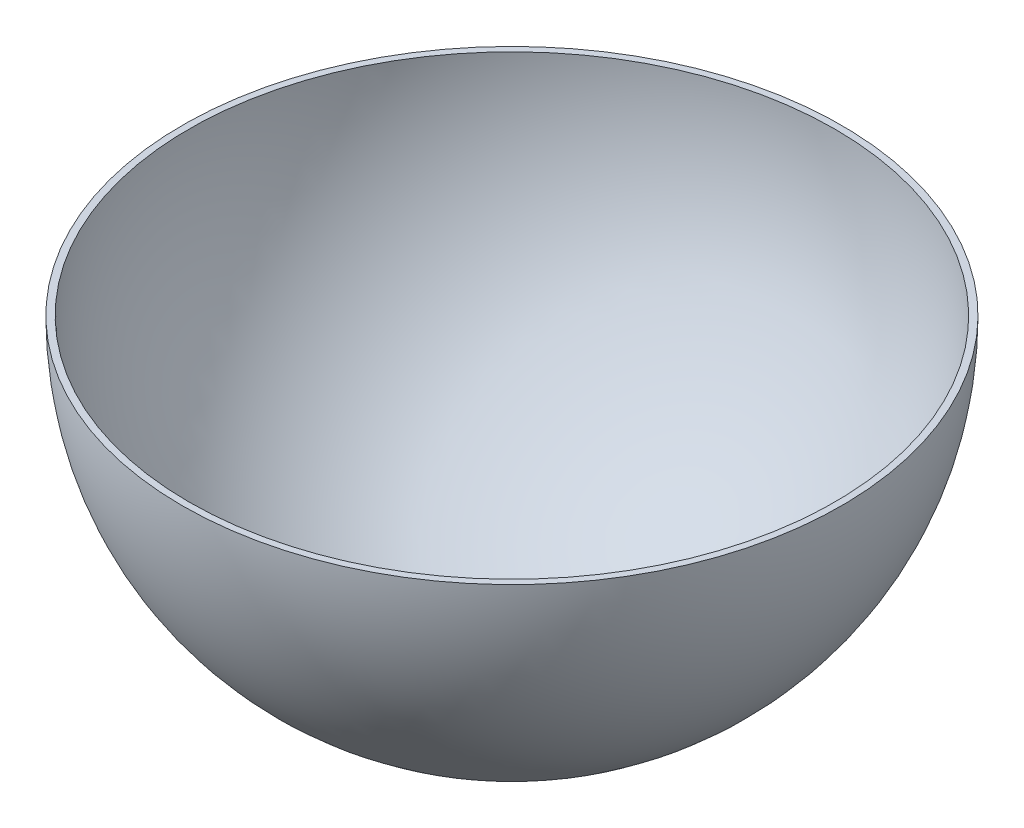
ISO-10303-21;
HEADER;
FILE_DESCRIPTION(('STEP AP214'),'2;1');
FILE_NAME('part.step','',(''),(''),'','','');
FILE_SCHEMA(('AUTOMOTIVE_DESIGN { 1 0 10303 214 1 1 1 1 }'));
ENDSEC;
DATA;
#1=APPLICATION_CONTEXT('core data for automotive mechanical design processes');
#2=APPLICATION_PROTOCOL_DEFINITION('international standard','automotive_design',2000,#1);
#3=PRODUCT_CONTEXT('',#1,'mechanical');
#4=PRODUCT('Part','Part','',(#3));
#5=PRODUCT_RELATED_PRODUCT_CATEGORY('part','',(#4));
#6=PRODUCT_DEFINITION_FORMATION('','',#4);
#7=PRODUCT_DEFINITION_CONTEXT('part definition',#1,'design');
#8=PRODUCT_DEFINITION('design','',#6,#7);
#9=PRODUCT_DEFINITION_SHAPE('','',#8);
#10=(LENGTH_UNIT() NAMED_UNIT(*) SI_UNIT(.MILLI.,.METRE.));
#11=(NAMED_UNIT(*) PLANE_ANGLE_UNIT() SI_UNIT($,.RADIAN.));
#12=(NAMED_UNIT(*) SI_UNIT($,.STERADIAN.) SOLID_ANGLE_UNIT());
#13=UNCERTAINTY_MEASURE_WITH_UNIT(LENGTH_MEASURE(1.E-05),#10,'distance_accuracy_value','');
#14=(GEOMETRIC_REPRESENTATION_CONTEXT(3) GLOBAL_UNCERTAINTY_ASSIGNED_CONTEXT((#13)) GLOBAL_UNIT_ASSIGNED_CONTEXT((#10,
#11,#12)) REPRESENTATION_CONTEXT('',''));
#15=CARTESIAN_POINT('',(0.,0.,0.));
#16=DIRECTION('',(0.,0.,1.));
#17=DIRECTION('',(1.,0.,0.));
#18=AXIS2_PLACEMENT_3D('',#15,#16,#17);
#19=CARTESIAN_POINT('',(0.,0.,0.));
#20=DIRECTION('',(-1.,0.,0.));
#21=DIRECTION('',(0.,-1.,0.));
#22=AXIS2_PLACEMENT_3D('',#19,#20,#21);
#23=SPHERICAL_SURFACE('',#22,98.);
#24=CARTESIAN_POINT('',(0.,0.,0.));
#25=DIRECTION('',(0.,1.,0.));
#26=DIRECTION('',(0.,0.,1.));
#27=AXIS2_PLACEMENT_3D('',#24,#25,#26);
#28=SPHERICAL_SURFACE('',#27,98.);
#29=CARTESIAN_POINT('',(0.,-97.9681070553065,0.));
#30=DIRECTION('',(0.,1.,0.));
#31=DIRECTION('',(0.,0.,1.));
#32=AXIS2_PLACEMENT_3D('',#29,#30,#31);
#33=CIRCLE('',#32,2.5);
#34=CARTESIAN_POINT('',(0.,-97.9681070553065,2.5));
#35=VERTEX_POINT('',#34);
#36=EDGE_CURVE('E47',#35,#35,#33,.T.);
#37=ORIENTED_EDGE('',*,*,#36,.F.);
#38=EDGE_LOOP('',(#37));
#39=FACE_BOUND('',#38,.T.);
#40=CARTESIAN_POINT('',(0.,0.,0.));
#41=DIRECTION('',(0.,1.,0.));
#42=DIRECTION('',(0.,0.,1.));
#43=AXIS2_PLACEMENT_3D('',#40,#41,#42);
#44=CIRCLE('',#43,98.);
#45=CARTESIAN_POINT('',(0.,0.,98.));
#46=VERTEX_POINT('',#45);
#47=EDGE_CURVE('E10',#46,#46,#44,.T.);
#48=ORIENTED_EDGE('',*,*,#47,.T.);
#49=EDGE_LOOP('',(#48));
#50=FACE_BOUND('',#49,.T.);
#51=ADVANCED_FACE('F36',(#39,#50),#28,.F.);
#52=CARTESIAN_POINT('',(0.,0.,0.));
#53=DIRECTION('',(0.,1.,0.));
#54=DIRECTION('',(0.,0.,1.));
#55=AXIS2_PLACEMENT_3D('',#52,#53,#54);
#56=PLANE('',#55);
#57=ORIENTED_EDGE('',*,*,#47,.F.);
#58=EDGE_LOOP('',(#57));
#59=FACE_BOUND('',#58,.T.);
#60=CARTESIAN_POINT('',(0.,0.,0.));
#61=DIRECTION('',(0.,1.,0.));
#62=DIRECTION('',(0.,0.,1.));
#63=AXIS2_PLACEMENT_3D('',#60,#61,#62);
#64=CIRCLE('',#63,100.);
#65=CARTESIAN_POINT('',(0.,0.,100.));
#66=VERTEX_POINT('',#65);
#67=EDGE_CURVE('E43',#66,#66,#64,.T.);
#68=ORIENTED_EDGE('',*,*,#67,.T.);
#69=EDGE_LOOP('',(#68));
#70=FACE_BOUND('',#69,.T.);
#71=ADVANCED_FACE('F61',(#59,#70),#56,.T.);
#72=CARTESIAN_POINT('',(0.,0.,0.));
#73=DIRECTION('',(-1.,0.,0.));
#74=DIRECTION('',(0.,1.,0.));
#75=AXIS2_PLACEMENT_3D('',#72,#73,#74);
#76=SPHERICAL_SURFACE('',#75,100.);
#77=CARTESIAN_POINT('',(0.,0.,0.));
#78=DIRECTION('',(0.,1.,0.));
#79=DIRECTION('',(0.,0.,1.));
#80=AXIS2_PLACEMENT_3D('',#77,#78,#79);
#81=SPHERICAL_SURFACE('',#80,100.);
#82=CARTESIAN_POINT('',(0.,-99.968745115661,0.));
#83=DIRECTION('',(0.,1.,0.));
#84=DIRECTION('',(0.,0.,1.));
#85=AXIS2_PLACEMENT_3D('',#82,#83,#84);
#86=CIRCLE('',#85,2.5);
#87=CARTESIAN_POINT('',(0.,-99.968745115661,2.5));
#88=VERTEX_POINT('',#87);
#89=EDGE_CURVE('E39',#88,#88,#86,.F.);
#90=ORIENTED_EDGE('',*,*,#89,.F.);
#91=EDGE_LOOP('',(#90));
#92=FACE_BOUND('',#91,.T.);
#93=ORIENTED_EDGE('',*,*,#67,.F.);
#94=EDGE_LOOP('',(#93));
#95=FACE_BOUND('',#94,.T.);
#96=ADVANCED_FACE('F58',(#92,#95),#81,.T.);
#97=CARTESIAN_POINT('',(0.,-100.,0.));
#98=DIRECTION('',(0.,1.,0.));
#99=DIRECTION('',(0.,0.,1.));
#100=AXIS2_PLACEMENT_3D('',#97,#98,#99);
#101=CYLINDRICAL_SURFACE('',#100,2.5);
#102=ORIENTED_EDGE('',*,*,#36,.T.);
#103=EDGE_LOOP('',(#102));
#104=FACE_BOUND('',#103,.T.);
#105=ORIENTED_EDGE('',*,*,#89,.T.);
#106=EDGE_LOOP('',(#105));
#107=FACE_BOUND('',#106,.T.);
#108=ADVANCED_FACE('F56',(#104,#107),#101,.F.);
#109=CLOSED_SHELL('',(#51,#71,#96,#108));
#110=MANIFOLD_SOLID_BREP('B2',#109);
#111=ADVANCED_BREP_SHAPE_REPRESENTATION('',(#18,#110),#14);
#112=SHAPE_DEFINITION_REPRESENTATION(#9,#111);
ENDSEC;
END-ISO-10303-21;
